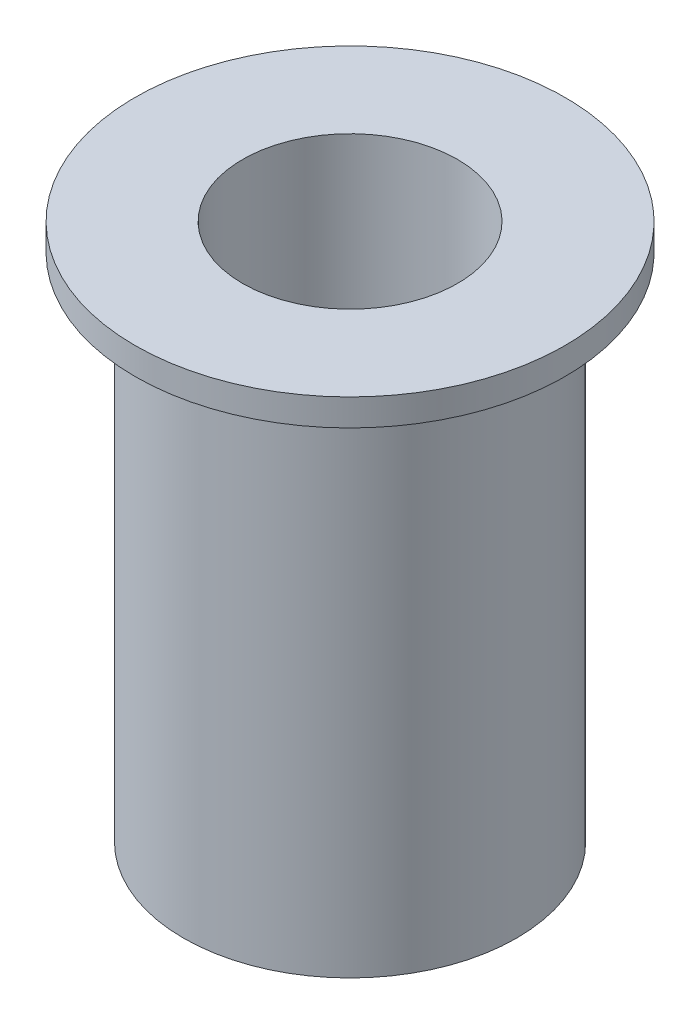
ISO-10303-21;
HEADER;
FILE_DESCRIPTION(('STEP AP214'),'2;1');
FILE_NAME('part.step','',(''),(''),'','','');
FILE_SCHEMA(('AUTOMOTIVE_DESIGN { 1 0 10303 214 1 1 1 1 }'));
ENDSEC;
DATA;
#1=APPLICATION_CONTEXT('core data for automotive mechanical design processes');
#2=APPLICATION_PROTOCOL_DEFINITION('international standard','automotive_design',2000,#1);
#3=PRODUCT_CONTEXT('',#1,'mechanical');
#4=PRODUCT('Part','Part','',(#3));
#5=PRODUCT_RELATED_PRODUCT_CATEGORY('part','',(#4));
#6=PRODUCT_DEFINITION_FORMATION('','',#4);
#7=PRODUCT_DEFINITION_CONTEXT('part definition',#1,'design');
#8=PRODUCT_DEFINITION('design','',#6,#7);
#9=PRODUCT_DEFINITION_SHAPE('','',#8);
#10=(LENGTH_UNIT() NAMED_UNIT(*) SI_UNIT(.MILLI.,.METRE.));
#11=(NAMED_UNIT(*) PLANE_ANGLE_UNIT() SI_UNIT($,.RADIAN.));
#12=(NAMED_UNIT(*) SI_UNIT($,.STERADIAN.) SOLID_ANGLE_UNIT());
#13=UNCERTAINTY_MEASURE_WITH_UNIT(LENGTH_MEASURE(1.E-05),#10,'distance_accuracy_value','');
#14=(GEOMETRIC_REPRESENTATION_CONTEXT(3) GLOBAL_UNCERTAINTY_ASSIGNED_CONTEXT((#13)) GLOBAL_UNIT_ASSIGNED_CONTEXT((#10,
#11,#12)) REPRESENTATION_CONTEXT('',''));
#15=CARTESIAN_POINT('',(0.,0.,0.));
#16=DIRECTION('',(0.,0.,1.));
#17=DIRECTION('',(1.,0.,0.));
#18=AXIS2_PLACEMENT_3D('',#15,#16,#17);
#19=CARTESIAN_POINT('',(2.,0.,0.));
#20=DIRECTION('',(0.,1.,0.));
#21=DIRECTION('',(0.,0.,1.));
#22=AXIS2_PLACEMENT_3D('',#19,#20,#21);
#23=PLANE('',#22);
#24=CARTESIAN_POINT('',(0.,0.,0.));
#25=DIRECTION('',(0.,1.,0.));
#26=DIRECTION('',(0.,0.,1.));
#27=AXIS2_PLACEMENT_3D('',#24,#25,#26);
#28=CIRCLE('',#27,3.1);
#29=CARTESIAN_POINT('',(0.,0.,3.1));
#30=VERTEX_POINT('',#29);
#31=EDGE_CURVE('E10',#30,#30,#28,.T.);
#32=ORIENTED_EDGE('',*,*,#31,.F.);
#33=EDGE_LOOP('',(#32));
#34=FACE_BOUND('',#33,.T.);
#35=CARTESIAN_POINT('',(0.,0.,0.));
#36=DIRECTION('',(0.,1.,0.));
#37=DIRECTION('',(0.,0.,1.));
#38=AXIS2_PLACEMENT_3D('',#35,#36,#37);
#39=CIRCLE('',#38,2.);
#40=CARTESIAN_POINT('',(0.,0.,2.));
#41=VERTEX_POINT('',#40);
#42=EDGE_CURVE('E57',#41,#41,#39,.T.);
#43=ORIENTED_EDGE('',*,*,#42,.T.);
#44=EDGE_LOOP('',(#43));
#45=FACE_BOUND('',#44,.T.);
#46=ADVANCED_FACE('F35',(#34,#45),#23,.F.);
#47=CARTESIAN_POINT('',(0.,10.,0.));
#48=DIRECTION('',(0.,1.,0.));
#49=DIRECTION('',(0.,0.,1.));
#50=AXIS2_PLACEMENT_3D('',#47,#48,#49);
#51=CYLINDRICAL_SURFACE('',#50,3.1);
#52=CARTESIAN_POINT('',(0.,9.5,0.));
#53=DIRECTION('',(0.,1.,0.));
#54=DIRECTION('',(0.,0.,1.));
#55=AXIS2_PLACEMENT_3D('',#52,#53,#54);
#56=CIRCLE('',#55,3.1);
#57=CARTESIAN_POINT('',(0.,9.5,3.1));
#58=VERTEX_POINT('',#57);
#59=EDGE_CURVE('E41',#58,#58,#56,.T.);
#60=ORIENTED_EDGE('',*,*,#59,.F.);
#61=EDGE_LOOP('',(#60));
#62=FACE_BOUND('',#61,.T.);
#63=ORIENTED_EDGE('',*,*,#31,.T.);
#64=EDGE_LOOP('',(#63));
#65=FACE_BOUND('',#64,.T.);
#66=ADVANCED_FACE('F82',(#62,#65),#51,.T.);
#67=CARTESIAN_POINT('',(3.1,9.5,0.));
#68=DIRECTION('',(0.,1.,0.));
#69=DIRECTION('',(0.,0.,1.));
#70=AXIS2_PLACEMENT_3D('',#67,#68,#69);
#71=PLANE('',#70);
#72=CARTESIAN_POINT('',(0.,9.5,0.));
#73=DIRECTION('',(0.,1.,0.));
#74=DIRECTION('',(0.,0.,1.));
#75=AXIS2_PLACEMENT_3D('',#72,#73,#74);
#76=CIRCLE('',#75,4.);
#77=CARTESIAN_POINT('',(0.,9.5,4.));
#78=VERTEX_POINT('',#77);
#79=EDGE_CURVE('E45',#78,#78,#76,.T.);
#80=ORIENTED_EDGE('',*,*,#79,.F.);
#81=EDGE_LOOP('',(#80));
#82=FACE_BOUND('',#81,.T.);
#83=ORIENTED_EDGE('',*,*,#59,.T.);
#84=EDGE_LOOP('',(#83));
#85=FACE_BOUND('',#84,.T.);
#86=ADVANCED_FACE('F77',(#82,#85),#71,.F.);
#87=CARTESIAN_POINT('',(0.,10.,0.));
#88=DIRECTION('',(0.,1.,0.));
#89=DIRECTION('',(0.,0.,1.));
#90=AXIS2_PLACEMENT_3D('',#87,#88,#89);
#91=CYLINDRICAL_SURFACE('',#90,4.);
#92=CARTESIAN_POINT('',(0.,10.,0.));
#93=DIRECTION('',(0.,1.,0.));
#94=DIRECTION('',(0.,0.,1.));
#95=AXIS2_PLACEMENT_3D('',#92,#93,#94);
#96=CIRCLE('',#95,4.);
#97=CARTESIAN_POINT('',(0.,10.,4.));
#98=VERTEX_POINT('',#97);
#99=EDGE_CURVE('E49',#98,#98,#96,.T.);
#100=ORIENTED_EDGE('',*,*,#99,.F.);
#101=EDGE_LOOP('',(#100));
#102=FACE_BOUND('',#101,.T.);
#103=ORIENTED_EDGE('',*,*,#79,.T.);
#104=EDGE_LOOP('',(#103));
#105=FACE_BOUND('',#104,.T.);
#106=ADVANCED_FACE('F71',(#102,#105),#91,.T.);
#107=CARTESIAN_POINT('',(4.,10.,0.));
#108=DIRECTION('',(0.,-1.,0.));
#109=DIRECTION('',(0.,0.,-1.));
#110=AXIS2_PLACEMENT_3D('',#107,#108,#109);
#111=PLANE('',#110);
#112=CARTESIAN_POINT('',(0.,10.,0.));
#113=DIRECTION('',(0.,1.,0.));
#114=DIRECTION('',(0.,0.,1.));
#115=AXIS2_PLACEMENT_3D('',#112,#113,#114);
#116=CIRCLE('',#115,2.);
#117=CARTESIAN_POINT('',(0.,10.,2.));
#118=VERTEX_POINT('',#117);
#119=EDGE_CURVE('E54',#118,#118,#116,.T.);
#120=ORIENTED_EDGE('',*,*,#119,.F.);
#121=EDGE_LOOP('',(#120));
#122=FACE_BOUND('',#121,.T.);
#123=ORIENTED_EDGE('',*,*,#99,.T.);
#124=EDGE_LOOP('',(#123));
#125=FACE_BOUND('',#124,.T.);
#126=ADVANCED_FACE('F65',(#122,#125),#111,.F.);
#127=CARTESIAN_POINT('',(0.,10.,0.));
#128=DIRECTION('',(0.,1.,0.));
#129=DIRECTION('',(0.,0.,1.));
#130=AXIS2_PLACEMENT_3D('',#127,#128,#129);
#131=CYLINDRICAL_SURFACE('',#130,2.);
#132=ORIENTED_EDGE('',*,*,#42,.F.);
#133=EDGE_LOOP('',(#132));
#134=FACE_BOUND('',#133,.T.);
#135=ORIENTED_EDGE('',*,*,#119,.T.);
#136=EDGE_LOOP('',(#135));
#137=FACE_BOUND('',#136,.T.);
#138=ADVANCED_FACE('F62',(#134,#137),#131,.F.);
#139=CLOSED_SHELL('',(#46,#66,#86,#106,#126,#138));
#140=MANIFOLD_SOLID_BREP('B2',#139);
#141=ADVANCED_BREP_SHAPE_REPRESENTATION('',(#18,#140),#14);
#142=SHAPE_DEFINITION_REPRESENTATION(#9,#141);
ENDSEC;
END-ISO-10303-21;
